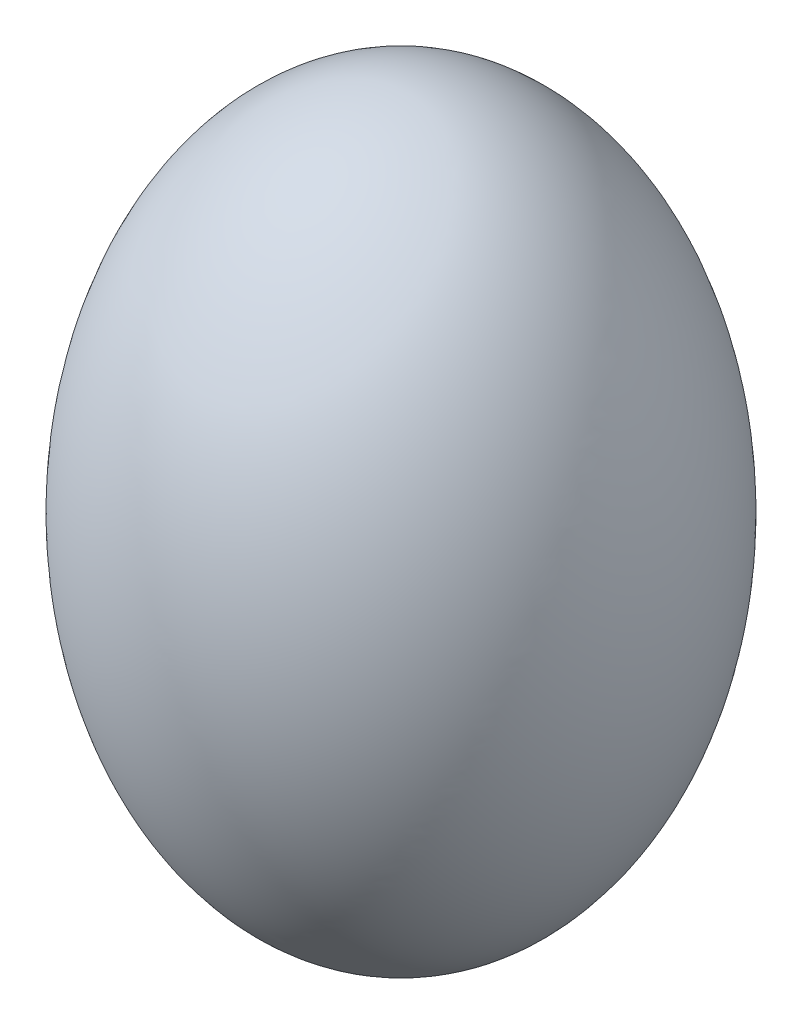
ISO-10303-21;
HEADER;
FILE_DESCRIPTION(('STEP AP214'),'2;1');
FILE_NAME('part.step','',(''),(''),'','','');
FILE_SCHEMA(('AUTOMOTIVE_DESIGN { 1 0 10303 214 1 1 1 1 }'));
ENDSEC;
DATA;
#1=APPLICATION_CONTEXT('core data for automotive mechanical design processes');
#2=APPLICATION_PROTOCOL_DEFINITION('international standard','automotive_design',2000,#1);
#3=PRODUCT_CONTEXT('',#1,'mechanical');
#4=PRODUCT('Part','Part','',(#3));
#5=PRODUCT_RELATED_PRODUCT_CATEGORY('part','',(#4));
#6=PRODUCT_DEFINITION_FORMATION('','',#4);
#7=PRODUCT_DEFINITION_CONTEXT('part definition',#1,'design');
#8=PRODUCT_DEFINITION('design','',#6,#7);
#9=PRODUCT_DEFINITION_SHAPE('','',#8);
#10=(LENGTH_UNIT() NAMED_UNIT(*) SI_UNIT(.MILLI.,.METRE.));
#11=(NAMED_UNIT(*) PLANE_ANGLE_UNIT() SI_UNIT($,.RADIAN.));
#12=(NAMED_UNIT(*) SI_UNIT($,.STERADIAN.) SOLID_ANGLE_UNIT());
#13=UNCERTAINTY_MEASURE_WITH_UNIT(LENGTH_MEASURE(1.E-05),#10,'distance_accuracy_value','');
#14=(GEOMETRIC_REPRESENTATION_CONTEXT(3) GLOBAL_UNCERTAINTY_ASSIGNED_CONTEXT((#13)) GLOBAL_UNIT_ASSIGNED_CONTEXT((#10,
#11,#12)) REPRESENTATION_CONTEXT('',''));
#15=CARTESIAN_POINT('',(0.,0.,0.));
#16=DIRECTION('',(0.,0.,1.));
#17=DIRECTION('',(1.,0.,0.));
#18=AXIS2_PLACEMENT_3D('',#15,#16,#17);
#19=CARTESIAN_POINT('',(0.,0.,0.));
#20=DIRECTION('',(0.,0.,1.));
#21=DIRECTION('',(0.,1.,0.));
#22=AXIS2_PLACEMENT_3D('',#19,#20,#21);
#23=ELLIPSE('',#22,32.5,22.5);
#24=TRIMMED_CURVE('',#23,(PARAMETER_VALUE(3.14159265358979)),
(PARAMETER_VALUE(6.28318530717959)),.T.,.PARAMETER.);
#25=CARTESIAN_POINT('',(0.,-32.5,0.));
#26=DIRECTION('',(0.,-1.,0.));
#27=AXIS1_PLACEMENT('',#25,#26);
#28=SURFACE_OF_REVOLUTION('',#24,#27);
#29=CARTESIAN_POINT('',(0.,32.5,0.));
#30=VERTEX_POINT('',#29);
#31=VERTEX_LOOP('',#30);
#32=FACE_BOUND('',#31,.T.);
#33=CARTESIAN_POINT('',(0.,-32.5,0.));
#34=VERTEX_POINT('',#33);
#35=VERTEX_LOOP('',#34);
#36=FACE_BOUND('',#35,.T.);
#37=ADVANCED_FACE('F32',(#32,#36),#28,.F.);
#38=CLOSED_SHELL('',(#37));
#39=MANIFOLD_SOLID_BREP('B2',#38);
#40=ADVANCED_BREP_SHAPE_REPRESENTATION('',(#18,#39),#14);
#41=SHAPE_DEFINITION_REPRESENTATION(#9,#40);
ENDSEC;
END-ISO-10303-21;
